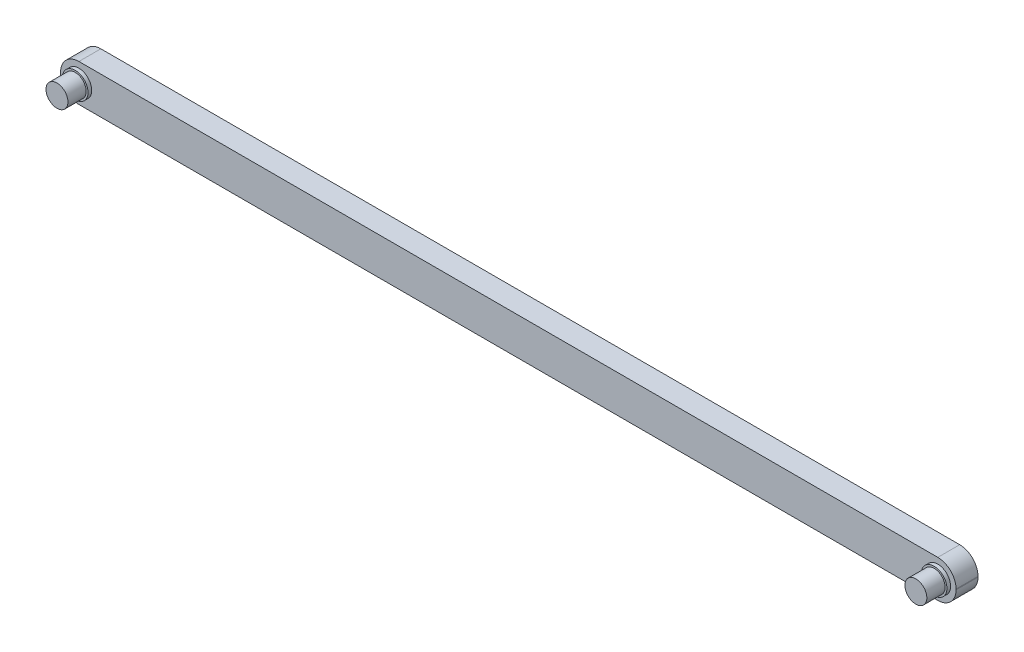
ISO-10303-21;
HEADER;
FILE_DESCRIPTION(('STEP AP214'),'2;1');
FILE_NAME('part.step','',(''),(''),'','','');
FILE_SCHEMA(('AUTOMOTIVE_DESIGN { 1 0 10303 214 1 1 1 1 }'));
ENDSEC;
DATA;
#1=APPLICATION_CONTEXT('core data for automotive mechanical design processes');
#2=APPLICATION_PROTOCOL_DEFINITION('international standard','automotive_design',2000,#1);
#3=PRODUCT_CONTEXT('',#1,'mechanical');
#4=PRODUCT('Part','Part','',(#3));
#5=PRODUCT_RELATED_PRODUCT_CATEGORY('part','',(#4));
#6=PRODUCT_DEFINITION_FORMATION('','',#4);
#7=PRODUCT_DEFINITION_CONTEXT('part definition',#1,'design');
#8=PRODUCT_DEFINITION('design','',#6,#7);
#9=PRODUCT_DEFINITION_SHAPE('','',#8);
#10=(LENGTH_UNIT() NAMED_UNIT(*) SI_UNIT(.MILLI.,.METRE.));
#11=(NAMED_UNIT(*) PLANE_ANGLE_UNIT() SI_UNIT($,.RADIAN.));
#12=(NAMED_UNIT(*) SI_UNIT($,.STERADIAN.) SOLID_ANGLE_UNIT());
#13=UNCERTAINTY_MEASURE_WITH_UNIT(LENGTH_MEASURE(1.E-05),#10,'distance_accuracy_value','');
#14=(GEOMETRIC_REPRESENTATION_CONTEXT(3) GLOBAL_UNCERTAINTY_ASSIGNED_CONTEXT((#13)) GLOBAL_UNIT_ASSIGNED_CONTEXT((#10,
#11,#12)) REPRESENTATION_CONTEXT('',''));
#15=CARTESIAN_POINT('',(0.,0.,0.));
#16=DIRECTION('',(0.,0.,1.));
#17=DIRECTION('',(1.,0.,0.));
#18=AXIS2_PLACEMENT_3D('',#15,#16,#17);
#19=CARTESIAN_POINT('',(61.25,5.09942638623328,6.));
#20=DIRECTION('',(-1.,0.,0.));
#21=DIRECTION('',(0.,0.,1.));
#22=AXIS2_PLACEMENT_3D('',#19,#20,#21);
#23=PLANE('',#22);
#24=DIRECTION('',(0.,1.,0.));
#25=VECTOR('',#24,1.);
#26=CARTESIAN_POINT('',(61.25,5.09942638623328,6.));
#27=LINE('',#26,#25);
#28=CARTESIAN_POINT('',(61.25,-0.0994263862332777,6.));
#29=VERTEX_POINT('',#28);
#30=CARTESIAN_POINT('',(61.25,0.0994263862332777,6.));
#31=VERTEX_POINT('',#30);
#32=EDGE_CURVE('E139',#29,#31,#27,.T.);
#33=ORIENTED_EDGE('',*,*,#32,.F.);
#34=DIRECTION('',(0.,0.,-1.));
#35=VECTOR('',#34,1.);
#36=CARTESIAN_POINT('',(61.25,-0.0994263862332777,6.));
#37=LINE('',#36,#35);
#38=CARTESIAN_POINT('',(61.25,-0.0994263862332777,0.));
#39=VERTEX_POINT('',#38);
#40=EDGE_CURVE('E124',#29,#39,#37,.T.);
#41=ORIENTED_EDGE('',*,*,#40,.T.);
#42=DIRECTION('',(0.,1.,0.));
#43=VECTOR('',#42,1.);
#44=CARTESIAN_POINT('',(61.25,5.09942638623328,0.));
#45=LINE('',#44,#43);
#46=CARTESIAN_POINT('',(61.25,0.0994263862332777,0.));
#47=VERTEX_POINT('',#46);
#48=EDGE_CURVE('E136',#39,#47,#45,.T.);
#49=ORIENTED_EDGE('',*,*,#48,.T.);
#50=DIRECTION('',(0.,0.,-1.));
#51=VECTOR('',#50,1.);
#52=CARTESIAN_POINT('',(61.25,0.0994263862332777,6.));
#53=LINE('',#52,#51);
#54=EDGE_CURVE('E141',#47,#31,#53,.F.);
#55=ORIENTED_EDGE('',*,*,#54,.T.);
#56=EDGE_LOOP('',(#33,#41,#49,#55));
#57=FACE_BOUND('',#56,.T.);
#58=ADVANCED_FACE('F39',(#57),#23,.F.);
#59=CARTESIAN_POINT('',(-61.25,5.09942638623328,6.));
#60=DIRECTION('',(0.,-1.,0.));
#61=DIRECTION('',(0.,0.,-1.));
#62=AXIS2_PLACEMENT_3D('',#59,#60,#61);
#63=PLANE('',#62);
#64=DIRECTION('',(-1.,0.,0.));
#65=VECTOR('',#64,1.);
#66=CARTESIAN_POINT('',(-61.25,5.09942638623328,0.));
#67=LINE('',#66,#65);
#68=CARTESIAN_POINT('',(56.25,5.09942638623328,0.));
#69=VERTEX_POINT('',#68);
#70=CARTESIAN_POINT('',(-178.75,5.09942638623328,0.));
#71=VERTEX_POINT('',#70);
#72=EDGE_CURVE('E146',#69,#71,#67,.T.);
#73=ORIENTED_EDGE('',*,*,#72,.T.);
#74=DIRECTION('',(0.,0.,-1.));
#75=VECTOR('',#74,1.);
#76=CARTESIAN_POINT('',(-178.75,5.09942638623328,6.));
#77=LINE('',#76,#75);
#78=CARTESIAN_POINT('',(-178.75,5.09942638623328,6.));
#79=VERTEX_POINT('',#78);
#80=EDGE_CURVE('E55',#71,#79,#77,.F.);
#81=ORIENTED_EDGE('',*,*,#80,.T.);
#82=DIRECTION('',(-1.,0.,0.));
#83=VECTOR('',#82,1.);
#84=CARTESIAN_POINT('',(-61.25,5.09942638623328,6.));
#85=LINE('',#84,#83);
#86=CARTESIAN_POINT('',(56.25,5.09942638623328,6.));
#87=VERTEX_POINT('',#86);
#88=EDGE_CURVE('E244',#87,#79,#85,.T.);
#89=ORIENTED_EDGE('',*,*,#88,.F.);
#90=DIRECTION('',(0.,0.,-1.));
#91=VECTOR('',#90,1.);
#92=CARTESIAN_POINT('',(56.25,5.09942638623328,6.));
#93=LINE('',#92,#91);
#94=EDGE_CURVE('E174',#87,#69,#93,.T.);
#95=ORIENTED_EDGE('',*,*,#94,.T.);
#96=EDGE_LOOP('',(#73,#81,#89,#95));
#97=FACE_BOUND('',#96,.T.);
#98=ADVANCED_FACE('F251',(#97),#63,.F.);
#99=CARTESIAN_POINT('',(-61.25,-5.09942638623328,6.));
#100=DIRECTION('',(0.,1.,0.));
#101=DIRECTION('',(0.,0.,1.));
#102=AXIS2_PLACEMENT_3D('',#99,#100,#101);
#103=PLANE('',#102);
#104=DIRECTION('',(1.,0.,0.));
#105=VECTOR('',#104,1.);
#106=CARTESIAN_POINT('',(-61.25,-5.09942638623328,6.));
#107=LINE('',#106,#105);
#108=CARTESIAN_POINT('',(-178.75,-5.09942638623328,6.));
#109=VERTEX_POINT('',#108);
#110=CARTESIAN_POINT('',(56.25,-5.09942638623328,6.));
#111=VERTEX_POINT('',#110);
#112=EDGE_CURVE('E158',#109,#111,#107,.T.);
#113=ORIENTED_EDGE('',*,*,#112,.F.);
#114=DIRECTION('',(0.,0.,-1.));
#115=VECTOR('',#114,1.);
#116=CARTESIAN_POINT('',(-178.75,-5.09942638623328,0.));
#117=LINE('',#116,#115);
#118=CARTESIAN_POINT('',(-178.75,-5.09942638623328,0.));
#119=VERTEX_POINT('',#118);
#120=EDGE_CURVE('E178',#109,#119,#117,.T.);
#121=ORIENTED_EDGE('',*,*,#120,.T.);
#122=DIRECTION('',(1.,0.,0.));
#123=VECTOR('',#122,1.);
#124=CARTESIAN_POINT('',(-61.25,-5.09942638623328,0.));
#125=LINE('',#124,#123);
#126=CARTESIAN_POINT('',(56.25,-5.09942638623328,0.));
#127=VERTEX_POINT('',#126);
#128=EDGE_CURVE('E151',#119,#127,#125,.T.);
#129=ORIENTED_EDGE('',*,*,#128,.T.);
#130=DIRECTION('',(0.,0.,-1.));
#131=VECTOR('',#130,1.);
#132=CARTESIAN_POINT('',(56.25,-5.09942638623328,6.));
#133=LINE('',#132,#131);
#134=EDGE_CURVE('E126',#127,#111,#133,.F.);
#135=ORIENTED_EDGE('',*,*,#134,.T.);
#136=EDGE_LOOP('',(#113,#121,#129,#135));
#137=FACE_BOUND('',#136,.T.);
#138=ADVANCED_FACE('F208',(#137),#103,.F.);
#139=CARTESIAN_POINT('',(0.,0.,6.));
#140=DIRECTION('',(0.,0.,1.));
#141=DIRECTION('',(1.,0.,0.));
#142=AXIS2_PLACEMENT_3D('',#139,#140,#141);
#143=PLANE('',#142);
#144=CARTESIAN_POINT('',(-178.75,0.,6.));
#145=DIRECTION('',(0.,0.,1.));
#146=DIRECTION('',(1.,0.,0.));
#147=AXIS2_PLACEMENT_3D('',#144,#145,#146);
#148=CIRCLE('',#147,3.49999999999999);
#149=CARTESIAN_POINT('',(-175.25,0.,6.));
#150=VERTEX_POINT('',#149);
#151=EDGE_CURVE('E48',#150,#150,#148,.T.);
#152=ORIENTED_EDGE('',*,*,#151,.F.);
#153=EDGE_LOOP('',(#152));
#154=FACE_BOUND('',#153,.T.);
#155=CARTESIAN_POINT('',(56.25,0.,6.));
#156=DIRECTION('',(0.,0.,1.));
#157=DIRECTION('',(1.,0.,0.));
#158=AXIS2_PLACEMENT_3D('',#155,#156,#157);
#159=CIRCLE('',#158,3.49999999999999);
#160=CARTESIAN_POINT('',(59.75,0.,6.));
#161=VERTEX_POINT('',#160);
#162=EDGE_CURVE('E155',#161,#161,#159,.T.);
#163=ORIENTED_EDGE('',*,*,#162,.F.);
#164=EDGE_LOOP('',(#163));
#165=FACE_BOUND('',#164,.T.);
#166=DIRECTION('',(0.,1.,0.));
#167=VECTOR('',#166,1.);
#168=CARTESIAN_POINT('',(-183.75,5.09942638623328,6.));
#169=LINE('',#168,#167);
#170=CARTESIAN_POINT('',(-183.75,-0.0994263862332777,6.));
#171=VERTEX_POINT('',#170);
#172=CARTESIAN_POINT('',(-183.75,0.0994263862332777,6.));
#173=VERTEX_POINT('',#172);
#174=EDGE_CURVE('E212',#171,#173,#169,.T.);
#175=ORIENTED_EDGE('',*,*,#174,.F.);
#176=CARTESIAN_POINT('',(-178.75,-0.0994263862332777,6.));
#177=DIRECTION('',(0.,0.,1.));
#178=DIRECTION('',(1.,0.,0.));
#179=AXIS2_PLACEMENT_3D('',#176,#177,#178);
#180=CIRCLE('',#179,5.);
#181=EDGE_CURVE('E194',#171,#109,#180,.T.);
#182=ORIENTED_EDGE('',*,*,#181,.T.);
#183=ORIENTED_EDGE('',*,*,#112,.T.);
#184=CARTESIAN_POINT('',(56.25,-0.0994263862332777,6.));
#185=DIRECTION('',(0.,0.,1.));
#186=DIRECTION('',(1.,0.,0.));
#187=AXIS2_PLACEMENT_3D('',#184,#185,#186);
#188=CIRCLE('',#187,5.);
#189=EDGE_CURVE('E171',#111,#29,#188,.T.);
#190=ORIENTED_EDGE('',*,*,#189,.T.);
#191=ORIENTED_EDGE('',*,*,#32,.T.);
#192=CARTESIAN_POINT('',(56.25,0.0994263862332777,6.));
#193=DIRECTION('',(0.,0.,1.));
#194=DIRECTION('',(1.,0.,0.));
#195=AXIS2_PLACEMENT_3D('',#192,#193,#194);
#196=CIRCLE('',#195,5.);
#197=EDGE_CURVE('E168',#31,#87,#196,.T.);
#198=ORIENTED_EDGE('',*,*,#197,.T.);
#199=ORIENTED_EDGE('',*,*,#88,.T.);
#200=CARTESIAN_POINT('',(-178.75,0.0994263862332777,6.));
#201=DIRECTION('',(0.,0.,1.));
#202=DIRECTION('',(1.,0.,0.));
#203=AXIS2_PLACEMENT_3D('',#200,#201,#202);
#204=CIRCLE('',#203,5.);
#205=EDGE_CURVE('E62',#79,#173,#204,.T.);
#206=ORIENTED_EDGE('',*,*,#205,.T.);
#207=EDGE_LOOP('',(#175,#182,#183,#190,#191,#198,#199,#206));
#208=FACE_BOUND('',#207,.T.);
#209=ADVANCED_FACE('F205',(#154,#165,#208),#143,.T.);
#210=CARTESIAN_POINT('',(0.,0.,0.));
#211=DIRECTION('',(0.,0.,1.));
#212=DIRECTION('',(1.,0.,0.));
#213=AXIS2_PLACEMENT_3D('',#210,#211,#212);
#214=PLANE('',#213);
#215=ORIENTED_EDGE('',*,*,#128,.F.);
#216=CARTESIAN_POINT('',(-178.75,-0.0994263862332777,0.));
#217=DIRECTION('',(0.,0.,1.));
#218=DIRECTION('',(1.,0.,0.));
#219=AXIS2_PLACEMENT_3D('',#216,#217,#218);
#220=CIRCLE('',#219,5.);
#221=CARTESIAN_POINT('',(-183.75,-0.0994263862332777,0.));
#222=VERTEX_POINT('',#221);
#223=EDGE_CURVE('E185',#119,#222,#220,.F.);
#224=ORIENTED_EDGE('',*,*,#223,.T.);
#225=DIRECTION('',(0.,1.,0.));
#226=VECTOR('',#225,1.);
#227=CARTESIAN_POINT('',(-183.75,5.09942638623328,0.));
#228=LINE('',#227,#226);
#229=CARTESIAN_POINT('',(-183.75,0.0994263862332777,0.));
#230=VERTEX_POINT('',#229);
#231=EDGE_CURVE('E218',#222,#230,#228,.T.);
#232=ORIENTED_EDGE('',*,*,#231,.T.);
#233=CARTESIAN_POINT('',(-178.75,0.0994263862332777,0.));
#234=DIRECTION('',(0.,0.,1.));
#235=DIRECTION('',(1.,0.,0.));
#236=AXIS2_PLACEMENT_3D('',#233,#234,#235);
#237=CIRCLE('',#236,5.);
#238=EDGE_CURVE('E182',#230,#71,#237,.F.);
#239=ORIENTED_EDGE('',*,*,#238,.T.);
#240=ORIENTED_EDGE('',*,*,#72,.F.);
#241=CARTESIAN_POINT('',(56.25,0.0994263862332777,0.));
#242=DIRECTION('',(0.,0.,1.));
#243=DIRECTION('',(1.,0.,0.));
#244=AXIS2_PLACEMENT_3D('',#241,#242,#243);
#245=CIRCLE('',#244,5.);
#246=EDGE_CURVE('E131',#69,#47,#245,.F.);
#247=ORIENTED_EDGE('',*,*,#246,.T.);
#248=ORIENTED_EDGE('',*,*,#48,.F.);
#249=CARTESIAN_POINT('',(56.25,-0.0994263862332777,0.));
#250=DIRECTION('',(0.,0.,1.));
#251=DIRECTION('',(1.,0.,0.));
#252=AXIS2_PLACEMENT_3D('',#249,#250,#251);
#253=CIRCLE('',#252,5.);
#254=EDGE_CURVE('E120',#39,#127,#253,.F.);
#255=ORIENTED_EDGE('',*,*,#254,.T.);
#256=EDGE_LOOP('',(#215,#224,#232,#239,#240,#247,#248,#255));
#257=FACE_BOUND('',#256,.T.);
#258=ADVANCED_FACE('F143',(#257),#214,.F.);
#259=CARTESIAN_POINT('',(56.25,-0.0994263862332777,6.));
#260=DIRECTION('',(0.,0.,-1.));
#261=DIRECTION('',(-1.,0.,0.));
#262=AXIS2_PLACEMENT_3D('',#259,#260,#261);
#263=CYLINDRICAL_SURFACE('',#262,5.);
#264=ORIENTED_EDGE('',*,*,#189,.F.);
#265=ORIENTED_EDGE('',*,*,#134,.F.);
#266=ORIENTED_EDGE('',*,*,#254,.F.);
#267=ORIENTED_EDGE('',*,*,#40,.F.);
#268=EDGE_LOOP('',(#264,#265,#266,#267));
#269=FACE_BOUND('',#268,.T.);
#270=ADVANCED_FACE('F123',(#269),#263,.T.);
#271=CARTESIAN_POINT('',(56.25,0.0994263862332777,6.));
#272=DIRECTION('',(0.,0.,-1.));
#273=DIRECTION('',(-1.,0.,0.));
#274=AXIS2_PLACEMENT_3D('',#271,#272,#273);
#275=CYLINDRICAL_SURFACE('',#274,5.);
#276=ORIENTED_EDGE('',*,*,#197,.F.);
#277=ORIENTED_EDGE('',*,*,#54,.F.);
#278=ORIENTED_EDGE('',*,*,#246,.F.);
#279=ORIENTED_EDGE('',*,*,#94,.F.);
#280=EDGE_LOOP('',(#276,#277,#278,#279));
#281=FACE_BOUND('',#280,.T.);
#282=ADVANCED_FACE('F250',(#281),#275,.T.);
#283=CARTESIAN_POINT('',(56.25,0.,7.));
#284=DIRECTION('',(0.,0.,-1.));
#285=DIRECTION('',(-1.,0.,0.));
#286=AXIS2_PLACEMENT_3D('',#283,#284,#285);
#287=CYLINDRICAL_SURFACE('',#286,3.49999999999999);
#288=CARTESIAN_POINT('',(56.25,0.,7.));
#289=DIRECTION('',(0.,0.,1.));
#290=DIRECTION('',(1.,0.,0.));
#291=AXIS2_PLACEMENT_3D('',#288,#289,#290);
#292=CIRCLE('',#291,3.49999999999999);
#293=CARTESIAN_POINT('',(59.75,0.,7.));
#294=VERTEX_POINT('',#293);
#295=EDGE_CURVE('E147',#294,#294,#292,.T.);
#296=ORIENTED_EDGE('',*,*,#295,.F.);
#297=EDGE_LOOP('',(#296));
#298=FACE_BOUND('',#297,.T.);
#299=ORIENTED_EDGE('',*,*,#162,.T.);
#300=EDGE_LOOP('',(#299));
#301=FACE_BOUND('',#300,.T.);
#302=ADVANCED_FACE('F272',(#298,#301),#287,.T.);
#303=CARTESIAN_POINT('',(56.25,0.,7.));
#304=DIRECTION('',(0.,0.,1.));
#305=DIRECTION('',(1.,0.,0.));
#306=AXIS2_PLACEMENT_3D('',#303,#304,#305);
#307=PLANE('',#306);
#308=CARTESIAN_POINT('',(56.25,0.,7.));
#309=DIRECTION('',(0.,0.,1.));
#310=DIRECTION('',(1.,0.,0.));
#311=AXIS2_PLACEMENT_3D('',#308,#309,#310);
#312=CIRCLE('',#311,2.99999999999999);
#313=CARTESIAN_POINT('',(59.25,0.,7.));
#314=VERTEX_POINT('',#313);
#315=EDGE_CURVE('E217',#314,#314,#312,.T.);
#316=ORIENTED_EDGE('',*,*,#315,.F.);
#317=EDGE_LOOP('',(#316));
#318=FACE_BOUND('',#317,.T.);
#319=ORIENTED_EDGE('',*,*,#295,.T.);
#320=EDGE_LOOP('',(#319));
#321=FACE_BOUND('',#320,.T.);
#322=ADVANCED_FACE('F276',(#318,#321),#307,.T.);
#323=CARTESIAN_POINT('',(56.25,0.,12.));
#324=DIRECTION('',(0.,0.,-1.));
#325=DIRECTION('',(-1.,0.,0.));
#326=AXIS2_PLACEMENT_3D('',#323,#324,#325);
#327=CYLINDRICAL_SURFACE('',#326,2.99999999999999);
#328=CARTESIAN_POINT('',(56.25,0.,12.));
#329=DIRECTION('',(0.,0.,1.));
#330=DIRECTION('',(1.,0.,0.));
#331=AXIS2_PLACEMENT_3D('',#328,#329,#330);
#332=CIRCLE('',#331,2.99999999999999);
#333=CARTESIAN_POINT('',(59.25,0.,12.));
#334=VERTEX_POINT('',#333);
#335=EDGE_CURVE('E234',#334,#334,#332,.T.);
#336=ORIENTED_EDGE('',*,*,#335,.F.);
#337=EDGE_LOOP('',(#336));
#338=FACE_BOUND('',#337,.T.);
#339=ORIENTED_EDGE('',*,*,#315,.T.);
#340=EDGE_LOOP('',(#339));
#341=FACE_BOUND('',#340,.T.);
#342=ADVANCED_FACE('F282',(#338,#341),#327,.T.);
#343=CARTESIAN_POINT('',(56.25,0.,12.));
#344=DIRECTION('',(0.,0.,1.));
#345=DIRECTION('',(1.,0.,0.));
#346=AXIS2_PLACEMENT_3D('',#343,#344,#345);
#347=PLANE('',#346);
#348=ORIENTED_EDGE('',*,*,#335,.T.);
#349=EDGE_LOOP('',(#348));
#350=FACE_BOUND('',#349,.T.);
#351=ADVANCED_FACE('F330',(#350),#347,.T.);
#352=CARTESIAN_POINT('',(-183.75,5.09942638623328,6.));
#353=DIRECTION('',(-1.,0.,0.));
#354=DIRECTION('',(0.,0.,1.));
#355=AXIS2_PLACEMENT_3D('',#352,#353,#354);
#356=PLANE('',#355);
#357=ORIENTED_EDGE('',*,*,#231,.F.);
#358=DIRECTION('',(0.,0.,-1.));
#359=VECTOR('',#358,1.);
#360=CARTESIAN_POINT('',(-183.75,-0.0994263862332777,6.));
#361=LINE('',#360,#359);
#362=EDGE_CURVE('E191',#222,#171,#361,.F.);
#363=ORIENTED_EDGE('',*,*,#362,.T.);
#364=ORIENTED_EDGE('',*,*,#174,.T.);
#365=DIRECTION('',(0.,0.,-1.));
#366=VECTOR('',#365,1.);
#367=CARTESIAN_POINT('',(-183.75,0.0994263862332777,0.));
#368=LINE('',#367,#366);
#369=EDGE_CURVE('E188',#173,#230,#368,.T.);
#370=ORIENTED_EDGE('',*,*,#369,.T.);
#371=EDGE_LOOP('',(#357,#363,#364,#370));
#372=FACE_BOUND('',#371,.T.);
#373=ADVANCED_FACE('F227',(#372),#356,.T.);
#374=CARTESIAN_POINT('',(-178.75,-0.0994263862332777,6.));
#375=DIRECTION('',(0.,0.,1.));
#376=DIRECTION('',(1.,0.,0.));
#377=AXIS2_PLACEMENT_3D('',#374,#375,#376);
#378=CYLINDRICAL_SURFACE('',#377,5.);
#379=ORIENTED_EDGE('',*,*,#181,.F.);
#380=ORIENTED_EDGE('',*,*,#362,.F.);
#381=ORIENTED_EDGE('',*,*,#223,.F.);
#382=ORIENTED_EDGE('',*,*,#120,.F.);
#383=EDGE_LOOP('',(#379,#380,#381,#382));
#384=FACE_BOUND('',#383,.T.);
#385=ADVANCED_FACE('F223',(#384),#378,.T.);
#386=CARTESIAN_POINT('',(-178.75,0.0994263862332777,6.));
#387=DIRECTION('',(0.,0.,1.));
#388=DIRECTION('',(1.,0.,0.));
#389=AXIS2_PLACEMENT_3D('',#386,#387,#388);
#390=CYLINDRICAL_SURFACE('',#389,5.);
#391=ORIENTED_EDGE('',*,*,#205,.F.);
#392=ORIENTED_EDGE('',*,*,#80,.F.);
#393=ORIENTED_EDGE('',*,*,#238,.F.);
#394=ORIENTED_EDGE('',*,*,#369,.F.);
#395=EDGE_LOOP('',(#391,#392,#393,#394));
#396=FACE_BOUND('',#395,.T.);
#397=ADVANCED_FACE('F41',(#396),#390,.T.);
#398=CARTESIAN_POINT('',(-178.75,0.,7.));
#399=DIRECTION('',(0.,0.,-1.));
#400=DIRECTION('',(-1.,0.,0.));
#401=AXIS2_PLACEMENT_3D('',#398,#399,#400);
#402=CYLINDRICAL_SURFACE('',#401,3.49999999999999);
#403=CARTESIAN_POINT('',(-178.75,0.,7.));
#404=DIRECTION('',(0.,0.,-1.));
#405=DIRECTION('',(-1.,0.,0.));
#406=AXIS2_PLACEMENT_3D('',#403,#404,#405);
#407=CIRCLE('',#406,3.49999999999999);
#408=CARTESIAN_POINT('',(-182.25,0.,7.));
#409=VERTEX_POINT('',#408);
#410=EDGE_CURVE('E228',#409,#409,#407,.T.);
#411=ORIENTED_EDGE('',*,*,#410,.T.);
#412=EDGE_LOOP('',(#411));
#413=FACE_BOUND('',#412,.T.);
#414=ORIENTED_EDGE('',*,*,#151,.T.);
#415=EDGE_LOOP('',(#414));
#416=FACE_BOUND('',#415,.T.);
#417=ADVANCED_FACE('F203',(#413,#416),#402,.T.);
#418=CARTESIAN_POINT('',(-178.75,0.,7.));
#419=DIRECTION('',(0.,0.,1.));
#420=DIRECTION('',(-1.,0.,0.));
#421=AXIS2_PLACEMENT_3D('',#418,#419,#420);
#422=PLANE('',#421);
#423=CARTESIAN_POINT('',(-178.75,0.,7.));
#424=DIRECTION('',(0.,0.,1.));
#425=DIRECTION('',(1.,0.,0.));
#426=AXIS2_PLACEMENT_3D('',#423,#424,#425);
#427=CIRCLE('',#426,2.99999999999999);
#428=CARTESIAN_POINT('',(-175.75,0.,7.));
#429=VERTEX_POINT('',#428);
#430=EDGE_CURVE('E11',#429,#429,#427,.T.);
#431=ORIENTED_EDGE('',*,*,#430,.F.);
#432=EDGE_LOOP('',(#431));
#433=FACE_BOUND('',#432,.T.);
#434=ORIENTED_EDGE('',*,*,#410,.F.);
#435=EDGE_LOOP('',(#434));
#436=FACE_BOUND('',#435,.T.);
#437=ADVANCED_FACE('F258',(#433,#436),#422,.T.);
#438=CARTESIAN_POINT('',(-178.75,0.,12.));
#439=DIRECTION('',(0.,0.,-1.));
#440=DIRECTION('',(-1.,0.,0.));
#441=AXIS2_PLACEMENT_3D('',#438,#439,#440);
#442=CYLINDRICAL_SURFACE('',#441,2.99999999999999);
#443=CARTESIAN_POINT('',(-178.75,0.,12.));
#444=DIRECTION('',(0.,0.,-1.));
#445=DIRECTION('',(-1.,0.,0.));
#446=AXIS2_PLACEMENT_3D('',#443,#444,#445);
#447=CIRCLE('',#446,2.99999999999999);
#448=CARTESIAN_POINT('',(-181.75,0.,12.));
#449=VERTEX_POINT('',#448);
#450=EDGE_CURVE('E231',#449,#449,#447,.T.);
#451=ORIENTED_EDGE('',*,*,#450,.T.);
#452=EDGE_LOOP('',(#451));
#453=FACE_BOUND('',#452,.T.);
#454=ORIENTED_EDGE('',*,*,#430,.T.);
#455=EDGE_LOOP('',(#454));
#456=FACE_BOUND('',#455,.T.);
#457=ADVANCED_FACE('F392',(#453,#456),#442,.T.);
#458=CARTESIAN_POINT('',(-178.75,0.,12.));
#459=DIRECTION('',(0.,0.,1.));
#460=DIRECTION('',(-1.,0.,0.));
#461=AXIS2_PLACEMENT_3D('',#458,#459,#460);
#462=PLANE('',#461);
#463=ORIENTED_EDGE('',*,*,#450,.F.);
#464=EDGE_LOOP('',(#463));
#465=FACE_BOUND('',#464,.T.);
#466=ADVANCED_FACE('F402',(#465),#462,.T.);
#467=CLOSED_SHELL('',(#58,#98,#138,#209,#258,#270,#282,#302,#322,#342,#351,#373,#385,#397,#417,
#437,#457,#466));
#468=MANIFOLD_SOLID_BREP('B2',#467);
#469=ADVANCED_BREP_SHAPE_REPRESENTATION('',(#18,#468),#14);
#470=SHAPE_DEFINITION_REPRESENTATION(#9,#469);
ENDSEC;
END-ISO-10303-21;
